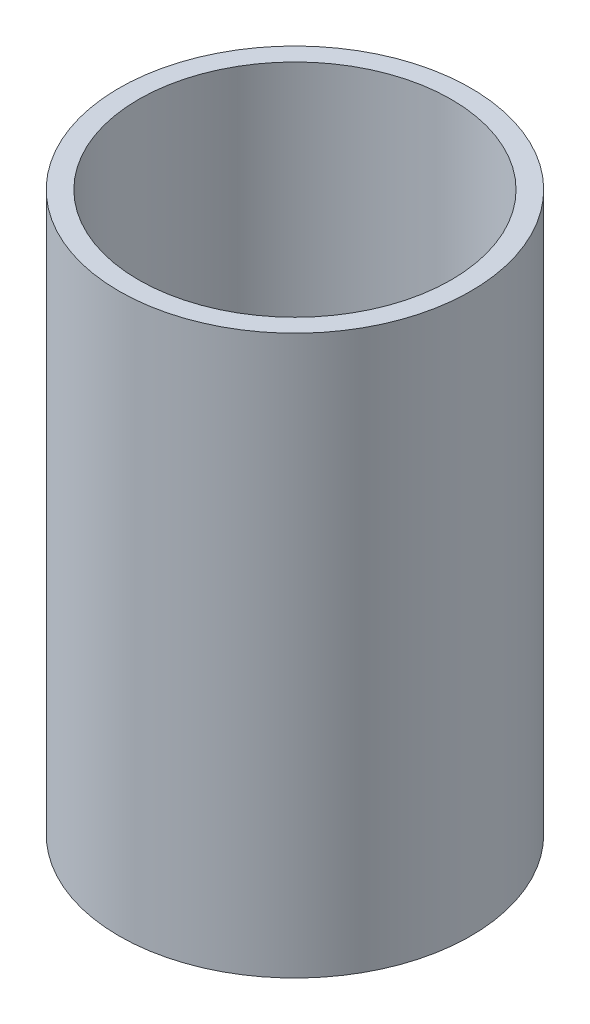
ISO-10303-21;
HEADER;
FILE_DESCRIPTION(('STEP AP214'),'2;1');
FILE_NAME('part.step','',(''),(''),'','','');
FILE_SCHEMA(('AUTOMOTIVE_DESIGN { 1 0 10303 214 1 1 1 1 }'));
ENDSEC;
DATA;
#1=APPLICATION_CONTEXT('core data for automotive mechanical design processes');
#2=APPLICATION_PROTOCOL_DEFINITION('international standard','automotive_design',2000,#1);
#3=PRODUCT_CONTEXT('',#1,'mechanical');
#4=PRODUCT('Part','Part','',(#3));
#5=PRODUCT_RELATED_PRODUCT_CATEGORY('part','',(#4));
#6=PRODUCT_DEFINITION_FORMATION('','',#4);
#7=PRODUCT_DEFINITION_CONTEXT('part definition',#1,'design');
#8=PRODUCT_DEFINITION('design','',#6,#7);
#9=PRODUCT_DEFINITION_SHAPE('','',#8);
#10=(LENGTH_UNIT() NAMED_UNIT(*) SI_UNIT(.MILLI.,.METRE.));
#11=(NAMED_UNIT(*) PLANE_ANGLE_UNIT() SI_UNIT($,.RADIAN.));
#12=(NAMED_UNIT(*) SI_UNIT($,.STERADIAN.) SOLID_ANGLE_UNIT());
#13=UNCERTAINTY_MEASURE_WITH_UNIT(LENGTH_MEASURE(1.E-05),#10,'distance_accuracy_value','');
#14=(GEOMETRIC_REPRESENTATION_CONTEXT(3) GLOBAL_UNCERTAINTY_ASSIGNED_CONTEXT((#13)) GLOBAL_UNIT_ASSIGNED_CONTEXT((#10,
#11,#12)) REPRESENTATION_CONTEXT('',''));
#15=CARTESIAN_POINT('',(0.,0.,0.));
#16=DIRECTION('',(0.,0.,1.));
#17=DIRECTION('',(1.,0.,0.));
#18=AXIS2_PLACEMENT_3D('',#15,#16,#17);
#19=CARTESIAN_POINT('',(0.,100.,0.));
#20=DIRECTION('',(0.,-1.,0.));
#21=DIRECTION('',(0.,0.,-1.));
#22=AXIS2_PLACEMENT_3D('',#19,#20,#21);
#23=CYLINDRICAL_SURFACE('',#22,31.5);
#24=CARTESIAN_POINT('',(0.,100.,0.));
#25=DIRECTION('',(0.,1.,0.));
#26=DIRECTION('',(0.,0.,1.));
#27=AXIS2_PLACEMENT_3D('',#24,#25,#26);
#28=CIRCLE('',#27,31.5);
#29=CARTESIAN_POINT('',(0.,100.,31.5));
#30=VERTEX_POINT('',#29);
#31=EDGE_CURVE('E10',#30,#30,#28,.T.);
#32=ORIENTED_EDGE('',*,*,#31,.F.);
#33=EDGE_LOOP('',(#32));
#34=FACE_BOUND('',#33,.T.);
#35=CARTESIAN_POINT('',(0.,0.,0.));
#36=DIRECTION('',(0.,1.,0.));
#37=DIRECTION('',(0.,0.,1.));
#38=AXIS2_PLACEMENT_3D('',#35,#36,#37);
#39=CIRCLE('',#38,31.5);
#40=CARTESIAN_POINT('',(0.,0.,31.5));
#41=VERTEX_POINT('',#40);
#42=EDGE_CURVE('E35',#41,#41,#39,.T.);
#43=ORIENTED_EDGE('',*,*,#42,.T.);
#44=EDGE_LOOP('',(#43));
#45=FACE_BOUND('',#44,.T.);
#46=ADVANCED_FACE('F32',(#34,#45),#23,.T.);
#47=CARTESIAN_POINT('',(0.,100.,0.));
#48=DIRECTION('',(0.,1.,0.));
#49=DIRECTION('',(0.,0.,1.));
#50=AXIS2_PLACEMENT_3D('',#47,#48,#49);
#51=PLANE('',#50);
#52=CARTESIAN_POINT('',(0.,100.,0.));
#53=DIRECTION('',(0.,1.,0.));
#54=DIRECTION('',(0.,0.,1.));
#55=AXIS2_PLACEMENT_3D('',#52,#53,#54);
#56=CIRCLE('',#55,28.);
#57=CARTESIAN_POINT('',(0.,100.,28.));
#58=VERTEX_POINT('',#57);
#59=EDGE_CURVE('E46',#58,#58,#56,.T.);
#60=ORIENTED_EDGE('',*,*,#59,.F.);
#61=EDGE_LOOP('',(#60));
#62=FACE_BOUND('',#61,.T.);
#63=ORIENTED_EDGE('',*,*,#31,.T.);
#64=EDGE_LOOP('',(#63));
#65=FACE_BOUND('',#64,.T.);
#66=ADVANCED_FACE('F53',(#62,#65),#51,.T.);
#67=CARTESIAN_POINT('',(0.,0.,0.));
#68=DIRECTION('',(0.,1.,0.));
#69=DIRECTION('',(0.,0.,1.));
#70=AXIS2_PLACEMENT_3D('',#67,#68,#69);
#71=PLANE('',#70);
#72=CARTESIAN_POINT('',(0.,0.,0.));
#73=DIRECTION('',(0.,1.,0.));
#74=DIRECTION('',(0.,0.,1.));
#75=AXIS2_PLACEMENT_3D('',#72,#73,#74);
#76=CIRCLE('',#75,28.);
#77=CARTESIAN_POINT('',(0.,0.,28.));
#78=VERTEX_POINT('',#77);
#79=EDGE_CURVE('E42',#78,#78,#76,.F.);
#80=ORIENTED_EDGE('',*,*,#79,.F.);
#81=EDGE_LOOP('',(#80));
#82=FACE_BOUND('',#81,.T.);
#83=ORIENTED_EDGE('',*,*,#42,.F.);
#84=EDGE_LOOP('',(#83));
#85=FACE_BOUND('',#84,.T.);
#86=ADVANCED_FACE('F55',(#82,#85),#71,.F.);
#87=CARTESIAN_POINT('',(0.,-0.001000000000001,0.));
#88=DIRECTION('',(0.,1.,0.));
#89=DIRECTION('',(0.,0.,1.));
#90=AXIS2_PLACEMENT_3D('',#87,#88,#89);
#91=CYLINDRICAL_SURFACE('',#90,28.);
#92=ORIENTED_EDGE('',*,*,#59,.T.);
#93=EDGE_LOOP('',(#92));
#94=FACE_BOUND('',#93,.T.);
#95=ORIENTED_EDGE('',*,*,#79,.T.);
#96=EDGE_LOOP('',(#95));
#97=FACE_BOUND('',#96,.T.);
#98=ADVANCED_FACE('F50',(#94,#97),#91,.F.);
#99=CLOSED_SHELL('',(#46,#66,#86,#98));
#100=MANIFOLD_SOLID_BREP('B2',#99);
#101=ADVANCED_BREP_SHAPE_REPRESENTATION('',(#18,#100),#14);
#102=SHAPE_DEFINITION_REPRESENTATION(#9,#101);
ENDSEC;
END-ISO-10303-21;
